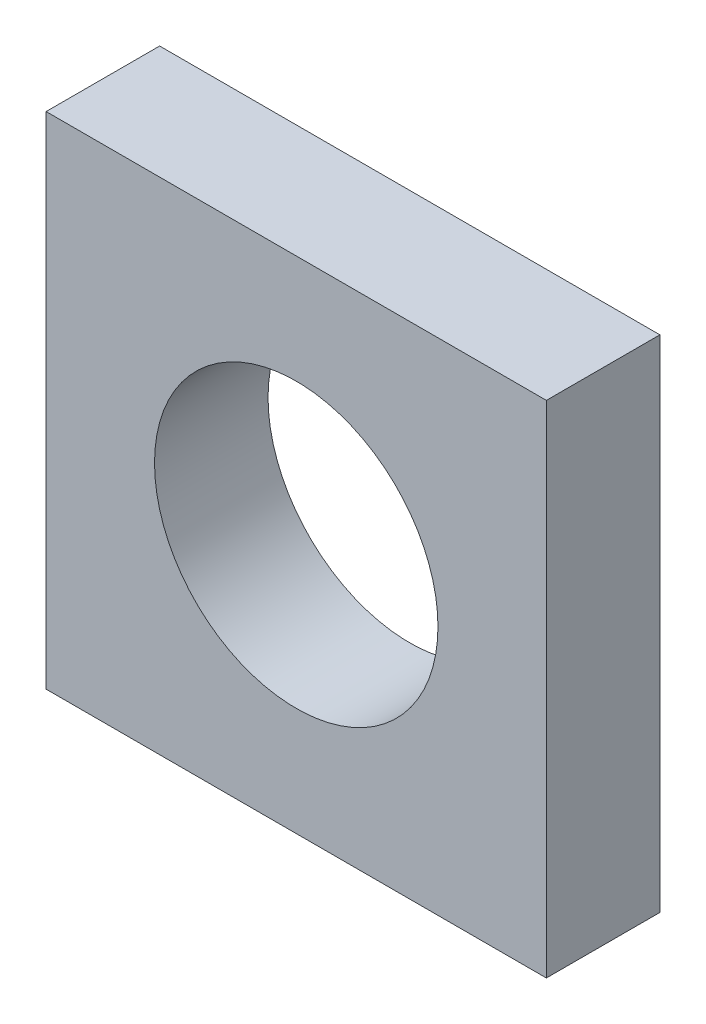
ISO-10303-21;
HEADER;
FILE_DESCRIPTION(('STEP AP214'),'2;1');
FILE_NAME('part.step','',(''),(''),'','','');
FILE_SCHEMA(('AUTOMOTIVE_DESIGN { 1 0 10303 214 1 1 1 1 }'));
ENDSEC;
DATA;
#1=APPLICATION_CONTEXT('core data for automotive mechanical design processes');
#2=APPLICATION_PROTOCOL_DEFINITION('international standard','automotive_design',2000,#1);
#3=PRODUCT_CONTEXT('',#1,'mechanical');
#4=PRODUCT('Part','Part','',(#3));
#5=PRODUCT_RELATED_PRODUCT_CATEGORY('part','',(#4));
#6=PRODUCT_DEFINITION_FORMATION('','',#4);
#7=PRODUCT_DEFINITION_CONTEXT('part definition',#1,'design');
#8=PRODUCT_DEFINITION('design','',#6,#7);
#9=PRODUCT_DEFINITION_SHAPE('','',#8);
#10=(LENGTH_UNIT() NAMED_UNIT(*) SI_UNIT(.MILLI.,.METRE.));
#11=(NAMED_UNIT(*) PLANE_ANGLE_UNIT() SI_UNIT($,.RADIAN.));
#12=(NAMED_UNIT(*) SI_UNIT($,.STERADIAN.) SOLID_ANGLE_UNIT());
#13=UNCERTAINTY_MEASURE_WITH_UNIT(LENGTH_MEASURE(1.E-05),#10,'distance_accuracy_value','');
#14=(GEOMETRIC_REPRESENTATION_CONTEXT(3) GLOBAL_UNCERTAINTY_ASSIGNED_CONTEXT((#13)) GLOBAL_UNIT_ASSIGNED_CONTEXT((#10,
#11,#12)) REPRESENTATION_CONTEXT('',''));
#15=CARTESIAN_POINT('',(0.,0.,0.));
#16=DIRECTION('',(0.,0.,1.));
#17=DIRECTION('',(1.,0.,0.));
#18=AXIS2_PLACEMENT_3D('',#15,#16,#17);
#19=CARTESIAN_POINT('',(0.,0.,-10.73));
#20=DIRECTION('',(0.,0.,-1.));
#21=DIRECTION('',(-1.,0.,0.));
#22=AXIS2_PLACEMENT_3D('',#19,#20,#21);
#23=PLANE('',#22);
#24=CARTESIAN_POINT('',(12.5,0.,-10.73));
#25=DIRECTION('',(0.,0.,-1.));
#26=DIRECTION('',(-1.,0.,0.));
#27=AXIS2_PLACEMENT_3D('',#24,#25,#26);
#28=CIRCLE('',#27,1.4732);
#29=CARTESIAN_POINT('',(11.0268,0.,-10.73));
#30=VERTEX_POINT('',#29);
#31=EDGE_CURVE('E20',#30,#30,#28,.F.);
#32=ORIENTED_EDGE('',*,*,#31,.T.);
#33=EDGE_LOOP('',(#32));
#34=FACE_BOUND('',#33,.T.);
#35=DIRECTION('',(1.,0.,0.));
#36=VECTOR('',#35,1.);
#37=CARTESIAN_POINT('',(9.9,2.6,-10.73));
#38=LINE('',#37,#36);
#39=CARTESIAN_POINT('',(15.1,2.6,-10.73));
#40=VERTEX_POINT('',#39);
#41=CARTESIAN_POINT('',(9.9,2.6,-10.73));
#42=VERTEX_POINT('',#41);
#43=EDGE_CURVE('E70',#40,#42,#38,.F.);
#44=ORIENTED_EDGE('',*,*,#43,.F.);
#45=DIRECTION('',(0.,1.,0.));
#46=VECTOR('',#45,1.);
#47=CARTESIAN_POINT('',(15.1,2.6,-10.73));
#48=LINE('',#47,#46);
#49=CARTESIAN_POINT('',(15.1,-2.6,-10.73));
#50=VERTEX_POINT('',#49);
#51=EDGE_CURVE('E67',#50,#40,#48,.T.);
#52=ORIENTED_EDGE('',*,*,#51,.F.);
#53=DIRECTION('',(1.,0.,0.));
#54=VECTOR('',#53,1.);
#55=CARTESIAN_POINT('',(15.1,-2.6,-10.73));
#56=LINE('',#55,#54);
#57=CARTESIAN_POINT('',(9.9,-2.6,-10.73));
#58=VERTEX_POINT('',#57);
#59=EDGE_CURVE('E58',#58,#50,#56,.T.);
#60=ORIENTED_EDGE('',*,*,#59,.F.);
#61=DIRECTION('',(0.,1.,0.));
#62=VECTOR('',#61,1.);
#63=CARTESIAN_POINT('',(9.9,-2.6,-10.73));
#64=LINE('',#63,#62);
#65=EDGE_CURVE('E53',#42,#58,#64,.F.);
#66=ORIENTED_EDGE('',*,*,#65,.F.);
#67=EDGE_LOOP('',(#44,#52,#60,#66));
#68=FACE_BOUND('',#67,.T.);
#69=ADVANCED_FACE('F17',(#34,#68),#23,.T.);
#70=CARTESIAN_POINT('',(15.1,2.6,-9.55));
#71=DIRECTION('',(1.,0.,0.));
#72=DIRECTION('',(0.,0.,-1.));
#73=AXIS2_PLACEMENT_3D('',#70,#71,#72);
#74=PLANE('',#73);
#75=DIRECTION('',(0.,0.,1.));
#76=VECTOR('',#75,1.);
#77=CARTESIAN_POINT('',(15.1,2.6,-9.55));
#78=LINE('',#77,#76);
#79=CARTESIAN_POINT('',(15.1,2.6,-9.55));
#80=VERTEX_POINT('',#79);
#81=EDGE_CURVE('E82',#80,#40,#78,.F.);
#82=ORIENTED_EDGE('',*,*,#81,.F.);
#83=DIRECTION('',(0.,1.,0.));
#84=VECTOR('',#83,1.);
#85=CARTESIAN_POINT('',(15.1,0.,-9.55));
#86=LINE('',#85,#84);
#87=CARTESIAN_POINT('',(15.1,-2.6,-9.55));
#88=VERTEX_POINT('',#87);
#89=EDGE_CURVE('E77',#80,#88,#86,.F.);
#90=ORIENTED_EDGE('',*,*,#89,.T.);
#91=DIRECTION('',(0.,0.,-1.));
#92=VECTOR('',#91,1.);
#93=CARTESIAN_POINT('',(15.1,-2.6,-9.55));
#94=LINE('',#93,#92);
#95=EDGE_CURVE('E63',#50,#88,#94,.F.);
#96=ORIENTED_EDGE('',*,*,#95,.F.);
#97=ORIENTED_EDGE('',*,*,#51,.T.);
#98=EDGE_LOOP('',(#82,#90,#96,#97));
#99=FACE_BOUND('',#98,.T.);
#100=ADVANCED_FACE('F76',(#99),#74,.T.);
#101=CARTESIAN_POINT('',(15.1,-2.6,-9.55));
#102=DIRECTION('',(0.,-1.,0.));
#103=DIRECTION('',(0.,0.,-1.));
#104=AXIS2_PLACEMENT_3D('',#101,#102,#103);
#105=PLANE('',#104);
#106=ORIENTED_EDGE('',*,*,#95,.T.);
#107=DIRECTION('',(-1.,0.,0.));
#108=VECTOR('',#107,1.);
#109=CARTESIAN_POINT('',(0.,-2.6,-9.55));
#110=LINE('',#109,#108);
#111=CARTESIAN_POINT('',(9.9,-2.6,-9.55));
#112=VERTEX_POINT('',#111);
#113=EDGE_CURVE('E87',#88,#112,#110,.T.);
#114=ORIENTED_EDGE('',*,*,#113,.T.);
#115=DIRECTION('',(0.,0.,1.));
#116=VECTOR('',#115,1.);
#117=CARTESIAN_POINT('',(9.9,-2.6,-9.55));
#118=LINE('',#117,#116);
#119=EDGE_CURVE('E65',#58,#112,#118,.T.);
#120=ORIENTED_EDGE('',*,*,#119,.F.);
#121=ORIENTED_EDGE('',*,*,#59,.T.);
#122=EDGE_LOOP('',(#106,#114,#120,#121));
#123=FACE_BOUND('',#122,.T.);
#124=ADVANCED_FACE('F60',(#123),#105,.T.);
#125=CARTESIAN_POINT('',(9.9,-2.6,-9.55));
#126=DIRECTION('',(-1.,0.,0.));
#127=DIRECTION('',(0.,0.,1.));
#128=AXIS2_PLACEMENT_3D('',#125,#126,#127);
#129=PLANE('',#128);
#130=ORIENTED_EDGE('',*,*,#119,.T.);
#131=DIRECTION('',(0.,1.,0.));
#132=VECTOR('',#131,1.);
#133=CARTESIAN_POINT('',(9.9,0.,-9.55));
#134=LINE('',#133,#132);
#135=CARTESIAN_POINT('',(9.9,2.6,-9.55));
#136=VERTEX_POINT('',#135);
#137=EDGE_CURVE('E89',#112,#136,#134,.T.);
#138=ORIENTED_EDGE('',*,*,#137,.T.);
#139=DIRECTION('',(0.,0.,1.));
#140=VECTOR('',#139,1.);
#141=CARTESIAN_POINT('',(9.9,2.6,-9.55));
#142=LINE('',#141,#140);
#143=EDGE_CURVE('E34',#42,#136,#142,.T.);
#144=ORIENTED_EDGE('',*,*,#143,.F.);
#145=ORIENTED_EDGE('',*,*,#65,.T.);
#146=EDGE_LOOP('',(#130,#138,#144,#145));
#147=FACE_BOUND('',#146,.T.);
#148=ADVANCED_FACE('F96',(#147),#129,.T.);
#149=CARTESIAN_POINT('',(9.9,2.6,-9.55));
#150=DIRECTION('',(0.,1.,0.));
#151=DIRECTION('',(0.,0.,1.));
#152=AXIS2_PLACEMENT_3D('',#149,#150,#151);
#153=PLANE('',#152);
#154=ORIENTED_EDGE('',*,*,#143,.T.);
#155=DIRECTION('',(-1.,0.,0.));
#156=VECTOR('',#155,1.);
#157=CARTESIAN_POINT('',(0.,2.6,-9.55));
#158=LINE('',#157,#156);
#159=EDGE_CURVE('E26',#136,#80,#158,.F.);
#160=ORIENTED_EDGE('',*,*,#159,.T.);
#161=ORIENTED_EDGE('',*,*,#81,.T.);
#162=ORIENTED_EDGE('',*,*,#43,.T.);
#163=EDGE_LOOP('',(#154,#160,#161,#162));
#164=FACE_BOUND('',#163,.T.);
#165=ADVANCED_FACE('F92',(#164),#153,.T.);
#166=CARTESIAN_POINT('',(12.5,0.,-9.55));
#167=DIRECTION('',(0.,0.,-1.));
#168=DIRECTION('',(-1.,0.,0.));
#169=AXIS2_PLACEMENT_3D('',#166,#167,#168);
#170=CYLINDRICAL_SURFACE('',#169,1.4732);
#171=ORIENTED_EDGE('',*,*,#31,.F.);
#172=EDGE_LOOP('',(#171));
#173=FACE_BOUND('',#172,.T.);
#174=CARTESIAN_POINT('',(12.5,0.,-9.55));
#175=DIRECTION('',(0.,0.,-1.));
#176=DIRECTION('',(-1.,0.,0.));
#177=AXIS2_PLACEMENT_3D('',#174,#175,#176);
#178=CIRCLE('',#177,1.4732);
#179=CARTESIAN_POINT('',(11.0268,0.,-9.55));
#180=VERTEX_POINT('',#179);
#181=EDGE_CURVE('E11',#180,#180,#178,.F.);
#182=ORIENTED_EDGE('',*,*,#181,.T.);
#183=EDGE_LOOP('',(#182));
#184=FACE_BOUND('',#183,.T.);
#185=ADVANCED_FACE('F104',(#173,#184),#170,.F.);
#186=CARTESIAN_POINT('',(0.,0.,-9.55));
#187=DIRECTION('',(0.,0.,-1.));
#188=DIRECTION('',(-1.,0.,0.));
#189=AXIS2_PLACEMENT_3D('',#186,#187,#188);
#190=PLANE('',#189);
#191=ORIENTED_EDGE('',*,*,#181,.F.);
#192=EDGE_LOOP('',(#191));
#193=FACE_BOUND('',#192,.T.);
#194=ORIENTED_EDGE('',*,*,#137,.F.);
#195=ORIENTED_EDGE('',*,*,#113,.F.);
#196=ORIENTED_EDGE('',*,*,#89,.F.);
#197=ORIENTED_EDGE('',*,*,#159,.F.);
#198=EDGE_LOOP('',(#194,#195,#196,#197));
#199=FACE_BOUND('',#198,.T.);
#200=ADVANCED_FACE('F95',(#193,#199),#190,.F.);
#201=CLOSED_SHELL('',(#69,#100,#124,#148,#165,#185,#200));
#202=MANIFOLD_SOLID_BREP('B1',#201);
#203=ADVANCED_BREP_SHAPE_REPRESENTATION('',(#18,#202),#14);
#204=SHAPE_DEFINITION_REPRESENTATION(#9,#203);
ENDSEC;
END-ISO-10303-21;
